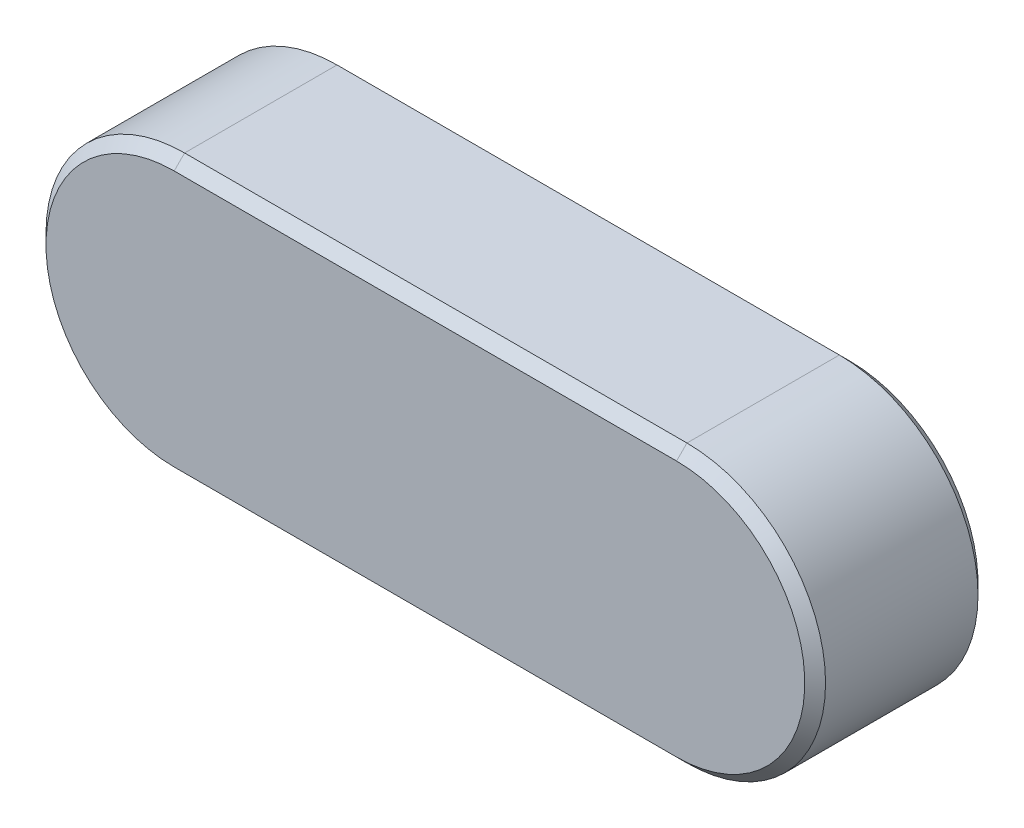
ISO-10303-21;
HEADER;
FILE_DESCRIPTION(('STEP AP214'),'2;1');
FILE_NAME('part.step','',(''),(''),'','','');
FILE_SCHEMA(('AUTOMOTIVE_DESIGN { 1 0 10303 214 1 1 1 1 }'));
ENDSEC;
DATA;
#1=APPLICATION_CONTEXT('core data for automotive mechanical design processes');
#2=APPLICATION_PROTOCOL_DEFINITION('international standard','automotive_design',2000,#1);
#3=PRODUCT_CONTEXT('',#1,'mechanical');
#4=PRODUCT('Part','Part','',(#3));
#5=PRODUCT_RELATED_PRODUCT_CATEGORY('part','',(#4));
#6=PRODUCT_DEFINITION_FORMATION('','',#4);
#7=PRODUCT_DEFINITION_CONTEXT('part definition',#1,'design');
#8=PRODUCT_DEFINITION('design','',#6,#7);
#9=PRODUCT_DEFINITION_SHAPE('','',#8);
#10=(LENGTH_UNIT() NAMED_UNIT(*) SI_UNIT(.MILLI.,.METRE.));
#11=(NAMED_UNIT(*) PLANE_ANGLE_UNIT() SI_UNIT($,.RADIAN.));
#12=(NAMED_UNIT(*) SI_UNIT($,.STERADIAN.) SOLID_ANGLE_UNIT());
#13=UNCERTAINTY_MEASURE_WITH_UNIT(LENGTH_MEASURE(1.E-05),#10,'distance_accuracy_value','');
#14=(GEOMETRIC_REPRESENTATION_CONTEXT(3) GLOBAL_UNCERTAINTY_ASSIGNED_CONTEXT((#13)) GLOBAL_UNIT_ASSIGNED_CONTEXT((#10,
#11,#12)) REPRESENTATION_CONTEXT('',''));
#15=CARTESIAN_POINT('',(0.,0.,0.));
#16=DIRECTION('',(0.,0.,1.));
#17=DIRECTION('',(1.,0.,0.));
#18=AXIS2_PLACEMENT_3D('',#15,#16,#17);
#19=CARTESIAN_POINT('',(2.63677968348475E-13,0.,5.));
#20=DIRECTION('',(0.,0.,1.));
#21=DIRECTION('',(1.,0.,0.));
#22=AXIS2_PLACEMENT_3D('',#19,#20,#21);
#23=PLANE('',#22);
#24=DIRECTION('',(1.,0.,0.));
#25=VECTOR('',#24,1.);
#26=CARTESIAN_POINT('',(0.,7.39999999999999,4.99999999999995));
#27=LINE('',#26,#25);
#28=CARTESIAN_POINT('',(-14.5,7.39999993522222,4.99999987044492));
#29=VERTEX_POINT('',#28);
#30=CARTESIAN_POINT('',(14.5,7.40000006477762,4.9999999352224));
#31=VERTEX_POINT('',#30);
#32=EDGE_CURVE('E89',#29,#31,#27,.T.);
#33=ORIENTED_EDGE('',*,*,#32,.F.);
#34=CARTESIAN_POINT('',(-14.4999999999997,0.,4.99999987044492));
#35=DIRECTION('',(0.,0.,-1.));
#36=DIRECTION('',(-1.,0.,0.));
#37=AXIS2_PLACEMENT_3D('',#34,#35,#36);
#38=CIRCLE('',#37,7.39999987044489);
#39=CARTESIAN_POINT('',(-14.4999999999997,-7.39999993522267,4.99999987044487));
#40=VERTEX_POINT('',#39);
#41=EDGE_CURVE('E62',#40,#29,#38,.T.);
#42=ORIENTED_EDGE('',*,*,#41,.F.);
#43=DIRECTION('',(1.,0.,0.));
#44=VECTOR('',#43,1.);
#45=CARTESIAN_POINT('',(2.4980018054066E-13,-7.40000000000018,4.99999999999989));
#46=LINE('',#45,#44);
#47=CARTESIAN_POINT('',(14.5000000000003,-7.39999993522267,4.99999987044485));
#48=VERTEX_POINT('',#47);
#49=EDGE_CURVE('E60',#48,#40,#46,.F.);
#50=ORIENTED_EDGE('',*,*,#49,.F.);
#51=CARTESIAN_POINT('',(14.5000000000003,0.,4.99999987044491));
#52=DIRECTION('',(0.,0.,-1.));
#53=DIRECTION('',(-1.,0.,0.));
#54=AXIS2_PLACEMENT_3D('',#51,#52,#53);
#55=CIRCLE('',#54,7.39999987044491);
#56=EDGE_CURVE('E19',#31,#48,#55,.T.);
#57=ORIENTED_EDGE('',*,*,#56,.F.);
#58=EDGE_LOOP('',(#33,#42,#50,#57));
#59=FACE_BOUND('',#58,.T.);
#60=ADVANCED_FACE('F16',(#59),#23,.T.);
#61=CARTESIAN_POINT('',(2.4980018054066E-13,-7.70000000000076,4.69999999999994));
#62=DIRECTION('',(0.,-0.707106781186551,0.707106781186551));
#63=DIRECTION('',(0.,-0.707106781186551,-0.707106781186551));
#64=AXIS2_PLACEMENT_3D('',#61,#62,#63);
#65=PLANE('',#64);
#66=DIRECTION('',(0.,0.707106768806912,0.70710679356618));
#67=VECTOR('',#66,1.);
#68=CARTESIAN_POINT('',(14.5000000000003,-7.38799967956019,5.0120000617501));
#69=LINE('',#68,#67);
#70=CARTESIAN_POINT('',(14.5000000000003,-7.99999996498529,4.39999996498502));
#71=VERTEX_POINT('',#70);
#72=EDGE_CURVE('E67',#48,#71,#69,.F.);
#73=ORIENTED_EDGE('',*,*,#72,.F.);
#74=ORIENTED_EDGE('',*,*,#49,.T.);
#75=DIRECTION('',(0.,0.707106768806912,0.70710679356618));
#76=VECTOR('',#75,1.);
#77=CARTESIAN_POINT('',(-14.4999999999997,-7.38799967956022,5.01200006175003));
#78=LINE('',#77,#76);
#79=CARTESIAN_POINT('',(-14.4999999999997,-7.99999996498449,4.39999996498509));
#80=VERTEX_POINT('',#79);
#81=EDGE_CURVE('E95',#80,#40,#78,.T.);
#82=ORIENTED_EDGE('',*,*,#81,.F.);
#83=DIRECTION('',(1.,0.,0.));
#84=VECTOR('',#83,1.);
#85=CARTESIAN_POINT('',(-22.4999999999997,-8.00000000000001,4.39999999999995));
#86=LINE('',#85,#84);
#87=EDGE_CURVE('E80',#71,#80,#86,.F.);
#88=ORIENTED_EDGE('',*,*,#87,.F.);
#89=EDGE_LOOP('',(#73,#74,#82,#88));
#90=FACE_BOUND('',#89,.T.);
#91=ADVANCED_FACE('F78',(#90),#65,.T.);
#92=CARTESIAN_POINT('',(14.5,-1.94289029309402E-13,4.39999985994044));
#93=DIRECTION('',(0.,0.,-1.));
#94=DIRECTION('',(-1.,0.,0.));
#95=AXIS2_PLACEMENT_3D('',#92,#93,#94);
#96=CONICAL_SURFACE('',#95,7.99999985994043,0.78539814589);
#97=DIRECTION('',(0.,-0.707106781186551,0.707106781186551));
#98=VECTOR('',#97,1.);
#99=CARTESIAN_POINT('',(14.5,7.69999999999976,4.69999999999994));
#100=LINE('',#99,#98);
#101=CARTESIAN_POINT('',(14.5,7.99999999999998,4.39999999999999));
#102=VERTEX_POINT('',#101);
#103=EDGE_CURVE('E76',#31,#102,#100,.F.);
#104=ORIENTED_EDGE('',*,*,#103,.F.);
#105=ORIENTED_EDGE('',*,*,#56,.T.);
#106=ORIENTED_EDGE('',*,*,#72,.T.);
#107=CARTESIAN_POINT('',(14.5,-5.27355936696949E-13,4.4));
#108=DIRECTION('',(0.,0.,-1.));
#109=DIRECTION('',(-1.,0.,0.));
#110=AXIS2_PLACEMENT_3D('',#107,#108,#109);
#111=CIRCLE('',#110,8.);
#112=EDGE_CURVE('E99',#102,#71,#111,.T.);
#113=ORIENTED_EDGE('',*,*,#112,.F.);
#114=EDGE_LOOP('',(#104,#105,#106,#113));
#115=FACE_BOUND('',#114,.T.);
#116=ADVANCED_FACE('F72',(#115),#96,.T.);
#117=CARTESIAN_POINT('',(0.,7.69999999999976,4.69999999999999));
#118=DIRECTION('',(0.,0.707106781186551,0.707106781186551));
#119=DIRECTION('',(0.,-0.707106781186551,0.707106781186551));
#120=AXIS2_PLACEMENT_3D('',#117,#118,#119);
#121=PLANE('',#120);
#122=DIRECTION('',(0.,-0.707106768806912,0.70710679356618));
#123=VECTOR('',#122,1.);
#124=CARTESIAN_POINT('',(-14.5,7.38799967955997,5.01200006175));
#125=LINE('',#124,#123);
#126=CARTESIAN_POINT('',(-14.5,7.99999996498574,4.39999996498502));
#127=VERTEX_POINT('',#126);
#128=EDGE_CURVE('E90',#29,#127,#125,.F.);
#129=ORIENTED_EDGE('',*,*,#128,.F.);
#130=ORIENTED_EDGE('',*,*,#32,.T.);
#131=ORIENTED_EDGE('',*,*,#103,.T.);
#132=DIRECTION('',(1.,0.,0.));
#133=VECTOR('',#132,1.);
#134=CARTESIAN_POINT('',(22.5,7.99999999999998,4.39999999999999));
#135=LINE('',#134,#133);
#136=EDGE_CURVE('E120',#127,#102,#135,.T.);
#137=ORIENTED_EDGE('',*,*,#136,.F.);
#138=EDGE_LOOP('',(#129,#130,#131,#137));
#139=FACE_BOUND('',#138,.T.);
#140=ADVANCED_FACE('F118',(#139),#121,.T.);
#141=CARTESIAN_POINT('',(-14.5,-2.22044604925031E-13,4.39999985994043));
#142=DIRECTION('',(0.,0.,-1.));
#143=DIRECTION('',(-1.,0.,0.));
#144=AXIS2_PLACEMENT_3D('',#141,#142,#143);
#145=CONICAL_SURFACE('',#144,7.99999985994045,0.78539814589);
#146=ORIENTED_EDGE('',*,*,#81,.T.);
#147=ORIENTED_EDGE('',*,*,#41,.T.);
#148=ORIENTED_EDGE('',*,*,#128,.T.);
#149=CARTESIAN_POINT('',(-14.5,-5.27355936696949E-13,4.40000000000009));
#150=DIRECTION('',(0.,0.,-1.));
#151=DIRECTION('',(-1.,0.,0.));
#152=AXIS2_PLACEMENT_3D('',#149,#150,#151);
#153=CIRCLE('',#152,8.);
#154=EDGE_CURVE('E144',#80,#127,#153,.T.);
#155=ORIENTED_EDGE('',*,*,#154,.F.);
#156=EDGE_LOOP('',(#146,#147,#148,#155));
#157=FACE_BOUND('',#156,.T.);
#158=ADVANCED_FACE('F220',(#157),#145,.T.);
#159=CARTESIAN_POINT('',(-22.5,-8.0000000000002,-5.00000000000011));
#160=DIRECTION('',(0.,-1.,0.));
#161=DIRECTION('',(0.,0.,-1.));
#162=AXIS2_PLACEMENT_3D('',#159,#160,#161);
#163=PLANE('',#162);
#164=DIRECTION('',(0.,0.,-1.));
#165=VECTOR('',#164,1.);
#166=CARTESIAN_POINT('',(-14.4999999999997,-8.0000000000002,5.01564799999995));
#167=LINE('',#166,#165);
#168=CARTESIAN_POINT('',(-14.5,-7.99999992997041,-4.39999989495537));
#169=VERTEX_POINT('',#168);
#170=EDGE_CURVE('E141',#169,#80,#167,.F.);
#171=ORIENTED_EDGE('',*,*,#170,.F.);
#172=DIRECTION('',(1.,0.,0.));
#173=VECTOR('',#172,1.);
#174=CARTESIAN_POINT('',(0.,-8.00000000000073,-4.40000000000013));
#175=LINE('',#174,#173);
#176=CARTESIAN_POINT('',(14.5,-7.99999992997105,-4.39999992997018));
#177=VERTEX_POINT('',#176);
#178=EDGE_CURVE('E161',#177,#169,#175,.F.);
#179=ORIENTED_EDGE('',*,*,#178,.F.);
#180=DIRECTION('',(0.,0.,-1.));
#181=VECTOR('',#180,1.);
#182=CARTESIAN_POINT('',(14.5000000000003,-8.0000000000002,5.01564799999994));
#183=LINE('',#182,#181);
#184=EDGE_CURVE('E112',#71,#177,#183,.T.);
#185=ORIENTED_EDGE('',*,*,#184,.F.);
#186=ORIENTED_EDGE('',*,*,#87,.T.);
#187=EDGE_LOOP('',(#171,#179,#185,#186));
#188=FACE_BOUND('',#187,.T.);
#189=ADVANCED_FACE('F222',(#188),#163,.T.);
#190=CARTESIAN_POINT('',(14.5000000000003,-7.49400541621981E-13,5.01564799999996));
#191=DIRECTION('',(0.,0.,-1.));
#192=DIRECTION('',(-1.,0.,0.));
#193=AXIS2_PLACEMENT_3D('',#190,#191,#192);
#194=CYLINDRICAL_SURFACE('',#193,8.);
#195=ORIENTED_EDGE('',*,*,#184,.T.);
#196=CARTESIAN_POINT('',(14.5,-7.49400541621981E-13,-4.39999985994044));
#197=DIRECTION('',(0.,0.,1.));
#198=DIRECTION('',(-1.,7.17364886173E-13,0.));
#199=AXIS2_PLACEMENT_3D('',#196,#197,#198);
#200=CIRCLE('',#199,7.99999985994044);
#201=CARTESIAN_POINT('',(14.5,7.99999996498493,-4.399999964985));
#202=VERTEX_POINT('',#201);
#203=EDGE_CURVE('E139',#202,#177,#200,.F.);
#204=ORIENTED_EDGE('',*,*,#203,.F.);
#205=DIRECTION('',(0.,0.,1.));
#206=VECTOR('',#205,1.);
#207=CARTESIAN_POINT('',(14.5,8.00000000000012,-5.0000000000001));
#208=LINE('',#207,#206);
#209=EDGE_CURVE('E129',#102,#202,#208,.F.);
#210=ORIENTED_EDGE('',*,*,#209,.F.);
#211=ORIENTED_EDGE('',*,*,#112,.T.);
#212=EDGE_LOOP('',(#195,#204,#210,#211));
#213=FACE_BOUND('',#212,.T.);
#214=ADVANCED_FACE('F137',(#213),#194,.T.);
#215=CARTESIAN_POINT('',(22.5,7.99999999999998,-4.9999999999999));
#216=DIRECTION('',(0.,1.,0.));
#217=DIRECTION('',(0.,0.,1.));
#218=AXIS2_PLACEMENT_3D('',#215,#216,#217);
#219=PLANE('',#218);
#220=ORIENTED_EDGE('',*,*,#209,.T.);
#221=DIRECTION('',(1.,0.,0.));
#222=VECTOR('',#221,1.);
#223=CARTESIAN_POINT('',(0.,7.99999999999917,-4.40000000000001));
#224=LINE('',#223,#222);
#225=CARTESIAN_POINT('',(-14.5,7.99999992997022,-4.39999992997028));
#226=VERTEX_POINT('',#225);
#227=EDGE_CURVE('E179',#226,#202,#224,.T.);
#228=ORIENTED_EDGE('',*,*,#227,.F.);
#229=DIRECTION('',(0.,0.,-1.));
#230=VECTOR('',#229,1.);
#231=CARTESIAN_POINT('',(-14.5,7.99999999999981,5.01564800000014));
#232=LINE('',#231,#230);
#233=EDGE_CURVE('E132',#127,#226,#232,.T.);
#234=ORIENTED_EDGE('',*,*,#233,.F.);
#235=ORIENTED_EDGE('',*,*,#136,.T.);
#236=EDGE_LOOP('',(#220,#228,#234,#235));
#237=FACE_BOUND('',#236,.T.);
#238=ADVANCED_FACE('F125',(#237),#219,.T.);
#239=CARTESIAN_POINT('',(-14.4999999999997,-7.49400541621981E-13,5.01564799999996));
#240=DIRECTION('',(0.,0.,-1.));
#241=DIRECTION('',(-1.,0.,0.));
#242=AXIS2_PLACEMENT_3D('',#239,#240,#241);
#243=CYLINDRICAL_SURFACE('',#242,8.);
#244=ORIENTED_EDGE('',*,*,#233,.T.);
#245=CARTESIAN_POINT('',(-14.5,-7.49400541621981E-13,-4.39999985994035));
#246=DIRECTION('',(0.,0.,1.));
#247=DIRECTION('',(1.,-7.17464466098E-13,0.));
#248=AXIS2_PLACEMENT_3D('',#245,#246,#247);
#249=CIRCLE('',#248,7.99999985994044);
#250=EDGE_CURVE('E192',#169,#226,#249,.F.);
#251=ORIENTED_EDGE('',*,*,#250,.F.);
#252=ORIENTED_EDGE('',*,*,#170,.T.);
#253=ORIENTED_EDGE('',*,*,#154,.T.);
#254=EDGE_LOOP('',(#244,#251,#252,#253));
#255=FACE_BOUND('',#254,.T.);
#256=ADVANCED_FACE('F247',(#255),#243,.T.);
#257=CARTESIAN_POINT('',(0.,-7.70000000000001,-4.69999999999998));
#258=DIRECTION('',(0.,-0.707106781186551,-0.707106781186551));
#259=DIRECTION('',(0.,0.707106781186551,-0.707106781186551));
#260=AXIS2_PLACEMENT_3D('',#257,#258,#259);
#261=PLANE('',#260);
#262=DIRECTION('',(0.,0.707106768806912,-0.70710679356618));
#263=VECTOR('',#262,1.);
#264=CARTESIAN_POINT('',(-14.5,-7.38799967956,-5.01200006175));
#265=LINE('',#264,#263);
#266=CARTESIAN_POINT('',(-14.5,-7.3999999352232,-4.9999998704448));
#267=VERTEX_POINT('',#266);
#268=EDGE_CURVE('E193',#267,#169,#265,.F.);
#269=ORIENTED_EDGE('',*,*,#268,.F.);
#270=DIRECTION('',(1.,0.,0.));
#271=VECTOR('',#270,1.);
#272=CARTESIAN_POINT('',(0.,-7.40000000000041,-5.));
#273=LINE('',#272,#271);
#274=CARTESIAN_POINT('',(14.5,-7.3999999352232,-4.99999987044491));
#275=VERTEX_POINT('',#274);
#276=EDGE_CURVE('E94',#267,#275,#273,.T.);
#277=ORIENTED_EDGE('',*,*,#276,.T.);
#278=DIRECTION('',(0.,0.707106768806912,-0.70710679356618));
#279=VECTOR('',#278,1.);
#280=CARTESIAN_POINT('',(14.5,-7.38799967956,-5.01200006175));
#281=LINE('',#280,#279);
#282=EDGE_CURVE('E175',#177,#275,#281,.T.);
#283=ORIENTED_EDGE('',*,*,#282,.F.);
#284=ORIENTED_EDGE('',*,*,#178,.T.);
#285=EDGE_LOOP('',(#269,#277,#283,#284));
#286=FACE_BOUND('',#285,.T.);
#287=ADVANCED_FACE('F244',(#286),#261,.T.);
#288=CARTESIAN_POINT('',(14.5,-7.49400541621981E-13,-4.39999985994044));
#289=DIRECTION('',(0.,0.,1.));
#290=DIRECTION('',(1.,0.,0.));
#291=AXIS2_PLACEMENT_3D('',#288,#289,#290);
#292=CONICAL_SURFACE('',#291,7.99999985994044,0.78539814589);
#293=ORIENTED_EDGE('',*,*,#282,.T.);
#294=CARTESIAN_POINT('',(14.5,-1.94289029309402E-13,-4.99999987044491));
#295=DIRECTION('',(0.,0.,1.));
#296=DIRECTION('',(1.,0.,0.));
#297=AXIS2_PLACEMENT_3D('',#294,#295,#296);
#298=CIRCLE('',#297,7.3999998704449);
#299=CARTESIAN_POINT('',(14.5,7.40000006477753,-4.99999993522251));
#300=VERTEX_POINT('',#299);
#301=EDGE_CURVE('E92',#275,#300,#298,.T.);
#302=ORIENTED_EDGE('',*,*,#301,.T.);
#303=DIRECTION('',(0.,0.707106781186551,0.707106781186551));
#304=VECTOR('',#303,1.);
#305=CARTESIAN_POINT('',(14.5,7.69999999999982,-4.7));
#306=LINE('',#305,#304);
#307=EDGE_CURVE('E183',#202,#300,#306,.F.);
#308=ORIENTED_EDGE('',*,*,#307,.F.);
#309=ORIENTED_EDGE('',*,*,#203,.T.);
#310=EDGE_LOOP('',(#293,#302,#308,#309));
#311=FACE_BOUND('',#310,.T.);
#312=ADVANCED_FACE('F213',(#311),#292,.T.);
#313=CARTESIAN_POINT('',(0.,7.69999999999982,-4.7));
#314=DIRECTION('',(0.,0.707106781186551,-0.707106781186551));
#315=DIRECTION('',(0.,0.707106781186551,0.707106781186551));
#316=AXIS2_PLACEMENT_3D('',#313,#314,#315);
#317=PLANE('',#316);
#318=ORIENTED_EDGE('',*,*,#307,.T.);
#319=DIRECTION('',(1.,0.,0.));
#320=VECTOR('',#319,1.);
#321=CARTESIAN_POINT('',(0.,7.40000000000007,-5.00000000000005));
#322=LINE('',#321,#320);
#323=CARTESIAN_POINT('',(-14.5,7.3999999352217,-4.99999987044496));
#324=VERTEX_POINT('',#323);
#325=EDGE_CURVE('E25',#300,#324,#322,.F.);
#326=ORIENTED_EDGE('',*,*,#325,.T.);
#327=DIRECTION('',(0.,-0.707106768806912,-0.70710679356618));
#328=VECTOR('',#327,1.);
#329=CARTESIAN_POINT('',(-14.5,7.38799967955991,-5.01200006175005));
#330=LINE('',#329,#328);
#331=EDGE_CURVE('E33',#226,#324,#330,.T.);
#332=ORIENTED_EDGE('',*,*,#331,.F.);
#333=ORIENTED_EDGE('',*,*,#227,.T.);
#334=EDGE_LOOP('',(#318,#326,#332,#333));
#335=FACE_BOUND('',#334,.T.);
#336=ADVANCED_FACE('F210',(#335),#317,.T.);
#337=CARTESIAN_POINT('',(-14.5,-7.49400541621981E-13,-4.39999985994035));
#338=DIRECTION('',(0.,0.,1.));
#339=DIRECTION('',(1.,0.,0.));
#340=AXIS2_PLACEMENT_3D('',#337,#338,#339);
#341=CONICAL_SURFACE('',#340,7.99999985994044,0.78539814589);
#342=ORIENTED_EDGE('',*,*,#331,.T.);
#343=CARTESIAN_POINT('',(-14.5,-1.94289029309402E-13,-4.99999987044489));
#344=DIRECTION('',(0.,0.,1.));
#345=DIRECTION('',(1.,0.,0.));
#346=AXIS2_PLACEMENT_3D('',#343,#344,#345);
#347=CIRCLE('',#346,7.3999998704449);
#348=EDGE_CURVE('E11',#324,#267,#347,.T.);
#349=ORIENTED_EDGE('',*,*,#348,.T.);
#350=ORIENTED_EDGE('',*,*,#268,.T.);
#351=ORIENTED_EDGE('',*,*,#250,.T.);
#352=EDGE_LOOP('',(#342,#349,#350,#351));
#353=FACE_BOUND('',#352,.T.);
#354=ADVANCED_FACE('F233',(#353),#341,.T.);
#355=CARTESIAN_POINT('',(0.,-8.32667268468867E-13,-5.00000000000006));
#356=DIRECTION('',(0.,0.,1.));
#357=DIRECTION('',(1.,0.,0.));
#358=AXIS2_PLACEMENT_3D('',#355,#356,#357);
#359=PLANE('',#358);
#360=ORIENTED_EDGE('',*,*,#325,.F.);
#361=ORIENTED_EDGE('',*,*,#301,.F.);
#362=ORIENTED_EDGE('',*,*,#276,.F.);
#363=ORIENTED_EDGE('',*,*,#348,.F.);
#364=EDGE_LOOP('',(#360,#361,#362,#363));
#365=FACE_BOUND('',#364,.T.);
#366=ADVANCED_FACE('F212',(#365),#359,.F.);
#367=CLOSED_SHELL('',(#60,#91,#116,#140,#158,#189,#214,#238,#256,#287,#312,#336,#354,#366));
#368=MANIFOLD_SOLID_BREP('B1',#367);
#369=ADVANCED_BREP_SHAPE_REPRESENTATION('',(#18,#368),#14);
#370=SHAPE_DEFINITION_REPRESENTATION(#9,#369);
ENDSEC;
END-ISO-10303-21;
